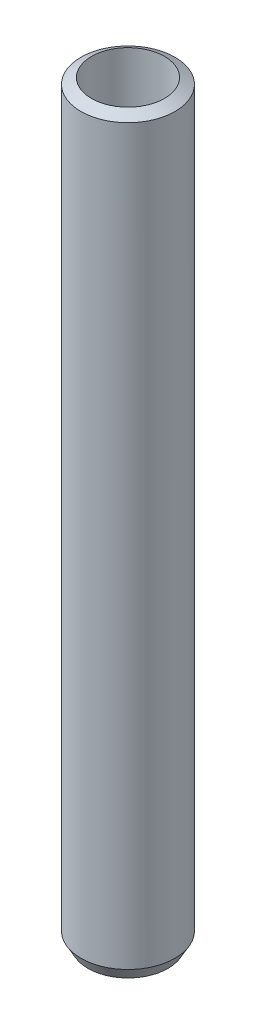
ISO-10303-21;
HEADER;
FILE_DESCRIPTION(('STEP AP214'),'2;1');
FILE_NAME('part.step','',(''),(''),'','','');
FILE_SCHEMA(('AUTOMOTIVE_DESIGN { 1 0 10303 214 1 1 1 1 }'));
ENDSEC;
DATA;
#1=APPLICATION_CONTEXT('core data for automotive mechanical design processes');
#2=APPLICATION_PROTOCOL_DEFINITION('international standard','automotive_design',2000,#1);
#3=PRODUCT_CONTEXT('',#1,'mechanical');
#4=PRODUCT('Part','Part','',(#3));
#5=PRODUCT_RELATED_PRODUCT_CATEGORY('part','',(#4));
#6=PRODUCT_DEFINITION_FORMATION('','',#4);
#7=PRODUCT_DEFINITION_CONTEXT('part definition',#1,'design');
#8=PRODUCT_DEFINITION('design','',#6,#7);
#9=PRODUCT_DEFINITION_SHAPE('','',#8);
#10=(LENGTH_UNIT() NAMED_UNIT(*) SI_UNIT(.MILLI.,.METRE.));
#11=(NAMED_UNIT(*) PLANE_ANGLE_UNIT() SI_UNIT($,.RADIAN.));
#12=(NAMED_UNIT(*) SI_UNIT($,.STERADIAN.) SOLID_ANGLE_UNIT());
#13=UNCERTAINTY_MEASURE_WITH_UNIT(LENGTH_MEASURE(1.E-05),#10,'distance_accuracy_value','');
#14=(GEOMETRIC_REPRESENTATION_CONTEXT(3) GLOBAL_UNCERTAINTY_ASSIGNED_CONTEXT((#13)) GLOBAL_UNIT_ASSIGNED_CONTEXT((#10,
#11,#12)) REPRESENTATION_CONTEXT('',''));
#15=CARTESIAN_POINT('',(0.,0.,0.));
#16=DIRECTION('',(0.,0.,1.));
#17=DIRECTION('',(1.,0.,0.));
#18=AXIS2_PLACEMENT_3D('',#15,#16,#17);
#19=CARTESIAN_POINT('',(0.,600.,0.));
#20=DIRECTION('',(0.,-1.,0.));
#21=DIRECTION('',(0.,0.,-1.));
#22=AXIS2_PLACEMENT_3D('',#19,#20,#21);
#23=CYLINDRICAL_SURFACE('',#22,37.5);
#24=CARTESIAN_POINT('',(0.,594.414314437915,0.));
#25=DIRECTION('',(0.,1.,0.));
#26=DIRECTION('',(0.,0.,1.));
#27=AXIS2_PLACEMENT_3D('',#24,#25,#26);
#28=CIRCLE('',#27,37.5);
#29=CARTESIAN_POINT('',(0.,594.414314437915,37.5));
#30=VERTEX_POINT('',#29);
#31=EDGE_CURVE('E50',#30,#30,#28,.F.);
#32=ORIENTED_EDGE('',*,*,#31,.T.);
#33=EDGE_LOOP('',(#32));
#34=FACE_BOUND('',#33,.T.);
#35=CARTESIAN_POINT('',(0.,9.82054255764875,0.));
#36=DIRECTION('',(0.,1.,0.));
#37=DIRECTION('',(0.,0.,1.));
#38=AXIS2_PLACEMENT_3D('',#35,#36,#37);
#39=CIRCLE('',#38,37.5);
#40=CARTESIAN_POINT('',(0.,9.82054255764875,37.5));
#41=VERTEX_POINT('',#40);
#42=EDGE_CURVE('E51',#41,#41,#39,.T.);
#43=ORIENTED_EDGE('',*,*,#42,.T.);
#44=EDGE_LOOP('',(#43));
#45=FACE_BOUND('',#44,.T.);
#46=ADVANCED_FACE('F39',(#34,#45),#23,.T.);
#47=CARTESIAN_POINT('',(0.,0.,0.));
#48=DIRECTION('',(0.,1.,0.));
#49=DIRECTION('',(0.,0.,1.));
#50=AXIS2_PLACEMENT_3D('',#47,#48,#49);
#51=PLANE('',#50);
#52=CARTESIAN_POINT('',(0.,0.,0.));
#53=DIRECTION('',(0.,1.,0.));
#54=DIRECTION('',(0.,0.,1.));
#55=AXIS2_PLACEMENT_3D('',#52,#53,#54);
#56=CIRCLE('',#55,31.9143144379152);
#57=CARTESIAN_POINT('',(0.,0.,31.9143144379152));
#58=VERTEX_POINT('',#57);
#59=EDGE_CURVE('E10',#58,#58,#56,.F.);
#60=ORIENTED_EDGE('',*,*,#59,.T.);
#61=EDGE_LOOP('',(#60));
#62=FACE_BOUND('',#61,.T.);
#63=CARTESIAN_POINT('',(0.,0.,0.));
#64=DIRECTION('',(0.,1.,0.));
#65=DIRECTION('',(0.,0.,1.));
#66=AXIS2_PLACEMENT_3D('',#63,#64,#65);
#67=CIRCLE('',#66,29.0903108135372);
#68=CARTESIAN_POINT('',(0.,0.,29.0903108135372));
#69=VERTEX_POINT('',#68);
#70=EDGE_CURVE('E58',#69,#69,#67,.T.);
#71=ORIENTED_EDGE('',*,*,#70,.T.);
#72=EDGE_LOOP('',(#71));
#73=FACE_BOUND('',#72,.T.);
#74=ADVANCED_FACE('F62',(#62,#73),#51,.F.);
#75=CARTESIAN_POINT('',(0.,600.,0.));
#76=DIRECTION('',(0.,-1.,0.));
#77=DIRECTION('',(0.,0.,-1.));
#78=AXIS2_PLACEMENT_3D('',#75,#76,#77);
#79=CYLINDRICAL_SURFACE('',#78,29.0903108135372);
#80=CARTESIAN_POINT('',(0.,599.197540944465,0.));
#81=DIRECTION('',(0.,-1.,0.));
#82=DIRECTION('',(0.,0.,-1.));
#83=AXIS2_PLACEMENT_3D('',#80,#81,#82);
#84=CIRCLE('',#83,29.0903108135372);
#85=CARTESIAN_POINT('',(0.,599.197540944465,-29.0903108135372));
#86=VERTEX_POINT('',#85);
#87=EDGE_CURVE('E54',#86,#86,#84,.F.);
#88=ORIENTED_EDGE('',*,*,#87,.T.);
#89=EDGE_LOOP('',(#88));
#90=FACE_BOUND('',#89,.T.);
#91=ORIENTED_EDGE('',*,*,#70,.F.);
#92=EDGE_LOOP('',(#91));
#93=FACE_BOUND('',#92,.T.);
#94=ADVANCED_FACE('F68',(#90,#93),#79,.F.);
#95=CARTESIAN_POINT('',(0.,600.,0.));
#96=DIRECTION('',(0.,-1.,0.));
#97=DIRECTION('',(0.,0.,-1.));
#98=AXIS2_PLACEMENT_3D('',#95,#96,#97);
#99=CONICAL_SURFACE('',#98,27.6794574423514,1.053652385998);
#100=ORIENTED_EDGE('',*,*,#31,.F.);
#101=EDGE_LOOP('',(#100));
#102=FACE_BOUND('',#101,.T.);
#103=ORIENTED_EDGE('',*,*,#87,.F.);
#104=EDGE_LOOP('',(#103));
#105=FACE_BOUND('',#104,.T.);
#106=ADVANCED_FACE('F66',(#102,#105),#99,.T.);
#107=CARTESIAN_POINT('',(0.,9.82054255764875,0.));
#108=DIRECTION('',(0.,1.,0.));
#109=DIRECTION('',(0.,0.,1.));
#110=AXIS2_PLACEMENT_3D('',#107,#108,#109);
#111=CONICAL_SURFACE('',#110,37.5,0.517143940796892);
#112=CARTESIAN_POINT('',(0.,0.,31.9143144379152));
#113=CARTESIAN_POINT('',(0.,0.10229731830884,31.9724986625202));
#114=CARTESIAN_POINT('',(0.,0.204594636617681,32.0306828871253));
#115=CARTESIAN_POINT('',(0.,0.409189273235362,32.1470513363354));
#116=CARTESIAN_POINT('',(0.,0.511486591544203,32.2052355609405));
#117=CARTESIAN_POINT('',(0.,0.716081228161886,32.3216040101506));
#118=CARTESIAN_POINT('',(0.,0.818378546470728,32.3797882347556));
#119=CARTESIAN_POINT('',(0.,1.02297318308841,32.4961566839657));
#120=CARTESIAN_POINT('',(0.,1.12527050139725,32.5543409085708));
#121=CARTESIAN_POINT('',(0.,1.32986513801493,32.6707093577809));
#122=CARTESIAN_POINT('',(0.,1.43216245632377,32.7288935823859));
#123=CARTESIAN_POINT('',(0.,1.63675709294146,32.845262031596));
#124=CARTESIAN_POINT('',(0.,1.7390544112503,32.9034462562011));
#125=CARTESIAN_POINT('',(0.,1.94364904786798,33.0198147054112));
#126=CARTESIAN_POINT('',(0.,2.04594636617682,33.0779989300162));
#127=CARTESIAN_POINT('',(0.,2.2505410027945,33.1943673792263));
#128=CARTESIAN_POINT('',(0.,2.35283832110334,33.2525516038313));
#129=CARTESIAN_POINT('',(0.,2.55743295772103,33.3689200530415));
#130=CARTESIAN_POINT('',(0.,2.65973027602987,33.4271042776465));
#131=CARTESIAN_POINT('',(0.,2.86432491264755,33.5434727268566));
#132=CARTESIAN_POINT('',(0.,2.96662223095639,33.6016569514617));
#133=CARTESIAN_POINT('',(0.,3.17121686757407,33.7180254006717));
#134=CARTESIAN_POINT('',(0.,3.27351418588292,33.7762096252768));
#135=CARTESIAN_POINT('',(0.,3.4781088225006,33.8925780744869));
#136=CARTESIAN_POINT('',(0.,3.58040614080944,33.9507622990919));
#137=CARTESIAN_POINT('',(0.,3.78500077742712,34.0671307483021));
#138=CARTESIAN_POINT('',(0.,3.88729809573596,34.1253149729071));
#139=CARTESIAN_POINT('',(0.,4.09189273235364,34.2416834221172));
#140=CARTESIAN_POINT('',(0.,4.19419005066248,34.2998676467222));
#141=CARTESIAN_POINT('',(0.,4.39878468728017,34.4162360959324));
#142=CARTESIAN_POINT('',(0.,4.50108200558901,34.4744203205374));
#143=CARTESIAN_POINT('',(0.,4.70567664220669,34.5907887697475));
#144=CARTESIAN_POINT('',(0.,4.80797396051553,34.6489729943526));
#145=CARTESIAN_POINT('',(0.,5.01256859713321,34.7653414435627));
#146=CARTESIAN_POINT('',(0.,5.11486591544206,34.8235256681677));
#147=CARTESIAN_POINT('',(0.,5.31946055205974,34.9398941173778));
#148=CARTESIAN_POINT('',(0.,5.42175787036858,34.9980783419829));
#149=CARTESIAN_POINT('',(0.,5.62635250698626,35.114446791193));
#150=CARTESIAN_POINT('',(0.,5.7286498252951,35.172631015798));
#151=CARTESIAN_POINT('',(0.,5.93324446191278,35.2889994650081));
#152=CARTESIAN_POINT('',(0.,6.03554178022163,35.3471836896132));
#153=CARTESIAN_POINT('',(0.,6.24013641683931,35.4635521388233));
#154=CARTESIAN_POINT('',(0.,6.34243373514815,35.5217363634283));
#155=CARTESIAN_POINT('',(0.,6.54702837176583,35.6381048126384));
#156=CARTESIAN_POINT('',(0.,6.64932569007467,35.6962890372435));
#157=CARTESIAN_POINT('',(0.,6.85392032669236,35.8126574864536));
#158=CARTESIAN_POINT('',(0.,6.9562176450012,35.8708417110586));
#159=CARTESIAN_POINT('',(0.,7.16081228161888,35.9872101602687));
#160=CARTESIAN_POINT('',(0.,7.26310959992772,36.0453943848738));
#161=CARTESIAN_POINT('',(0.,7.4677042365454,36.1617628340839));
#162=CARTESIAN_POINT('',(0.,7.57000155485424,36.2199470586889));
#163=CARTESIAN_POINT('',(0.,7.77459619147193,36.336315507899));
#164=CARTESIAN_POINT('',(0.,7.87689350978077,36.3944997325041));
#165=CARTESIAN_POINT('',(0.,8.08148814639845,36.5108681817142));
#166=CARTESIAN_POINT('',(0.,8.18378546470729,36.5690524063192));
#167=CARTESIAN_POINT('',(0.,8.38838010132497,36.6854208555293));
#168=CARTESIAN_POINT('',(0.,8.49067741963381,36.7436050801344));
#169=CARTESIAN_POINT('',(0.,8.6952720562515,36.8599735293445));
#170=CARTESIAN_POINT('',(0.,8.79756937456034,36.9181577539495));
#171=CARTESIAN_POINT('',(0.,9.00216401117802,37.0345262031596));
#172=CARTESIAN_POINT('',(0.,9.10446132948686,37.0927104277647));
#173=CARTESIAN_POINT('',(0.,9.30905596610454,37.2090788769748));
#174=CARTESIAN_POINT('',(0.,9.41135328441338,37.2672631015798));
#175=CARTESIAN_POINT('',(0.,9.61594792103106,37.3836315507899));
#176=CARTESIAN_POINT('',(0.,9.71824523933991,37.441815775395));
#177=CARTESIAN_POINT('',(0.,9.82054255764875,37.5));
#178=B_SPLINE_CURVE_WITH_KNOTS('',3,(#112,#113,#114,#115,#116,#117,#118,#119,#120,#121,#122,
#123,#124,#125,#126,#127,#128,#129,#130,#131,#132,#133,#134,#135,#136,#137,#138,#139,#140,#141,
#142,#143,#144,#145,#146,#147,#148,#149,#150,#151,#152,#153,#154,#155,#156,#157,#158,#159,#160,
#161,#162,#163,#164,#165,#166,#167,#168,#169,#170,#171,#172,#173,#174,#175,#176,#177),
.UNSPECIFIED.,.F.,.F.,(4,2,2,2,2,2,2,2,2,2,2,2,2,2,2,2,2,2,2,2,2,2,2,2,2,2,2,2,2,2,2,2,4),(0.,
0.353059921167274,0.706119842334548,1.05917976350182,1.41223968466909,1.76529960583637,
2.11835952700364,2.47141944817092,2.82447936933819,3.17753929050546,3.53059921167274,
3.88365913284001,4.23671905400728,4.58977897517456,4.94283889634183,5.2958988175091,
5.64895873867638,6.00201865984365,6.35507858101093,6.7081385021782,7.06119842334547,
7.41425834451274,7.76731826568002,8.12037818684729,8.47343810801457,8.82649802918184,
9.17955795034911,9.53261787151639,9.88567779268366,10.2387377138509,10.5917976350182,
10.9448575561855,11.2979174773528),.UNSPECIFIED.);
#179=EDGE_CURVE('BSEAM45',#58,#41,#178,.T.);
#180=ORIENTED_EDGE('',*,*,#59,.F.);
#181=ORIENTED_EDGE('',*,*,#42,.F.);
#182=ORIENTED_EDGE('',*,*,#179,.T.);
#183=ORIENTED_EDGE('',*,*,#179,.F.);
#184=EDGE_LOOP('',(#180,#182,#181,#183));
#185=FACE_BOUND('',#184,.T.);
#186=ADVANCED_FACE('F45',(#185),#111,.T.);
#187=CLOSED_SHELL('',(#46,#74,#94,#106,#186));
#188=MANIFOLD_SOLID_BREP('B2',#187);
#189=ADVANCED_BREP_SHAPE_REPRESENTATION('',(#18,#188),#14);
#190=SHAPE_DEFINITION_REPRESENTATION(#9,#189);
ENDSEC;
END-ISO-10303-21;
